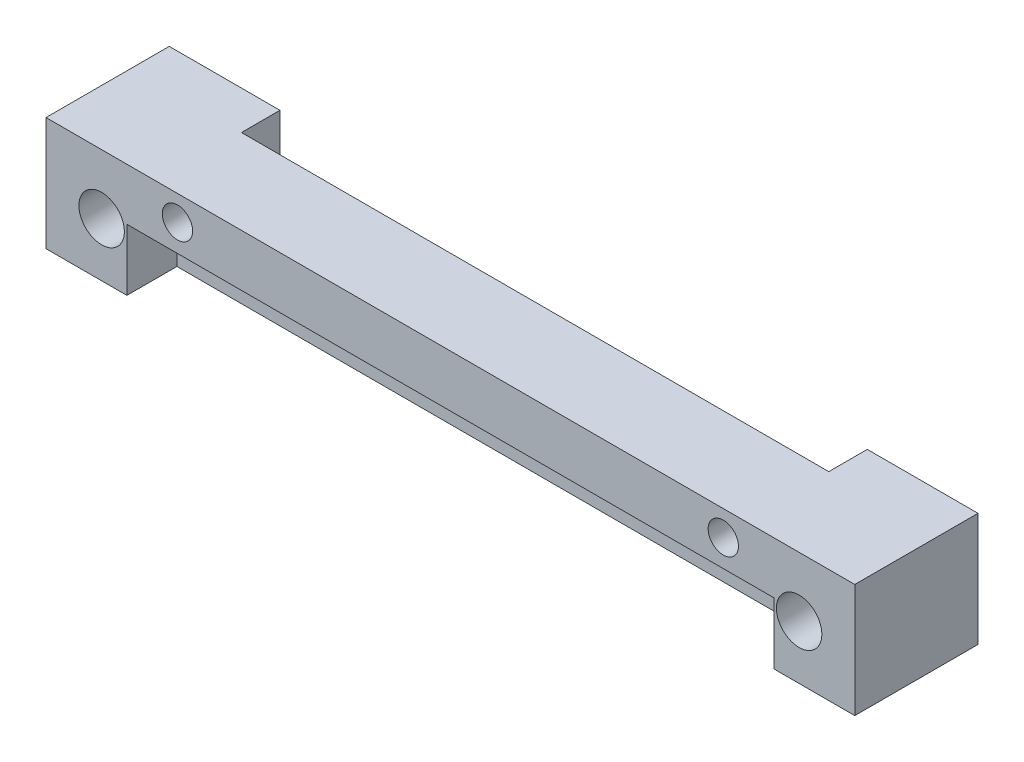
ISO-10303-21;
HEADER;
FILE_DESCRIPTION(('STEP AP214'),'2;1');
FILE_NAME('part.step','',(''),(''),'','','');
FILE_SCHEMA(('AUTOMOTIVE_DESIGN { 1 0 10303 214 1 1 1 1 }'));
ENDSEC;
DATA;
#1=APPLICATION_CONTEXT('core data for automotive mechanical design processes');
#2=APPLICATION_PROTOCOL_DEFINITION('international standard','automotive_design',2000,#1);
#3=PRODUCT_CONTEXT('',#1,'mechanical');
#4=PRODUCT('Part','Part','',(#3));
#5=PRODUCT_RELATED_PRODUCT_CATEGORY('part','',(#4));
#6=PRODUCT_DEFINITION_FORMATION('','',#4);
#7=PRODUCT_DEFINITION_CONTEXT('part definition',#1,'design');
#8=PRODUCT_DEFINITION('design','',#6,#7);
#9=PRODUCT_DEFINITION_SHAPE('','',#8);
#10=(LENGTH_UNIT() NAMED_UNIT(*) SI_UNIT(.MILLI.,.METRE.));
#11=(NAMED_UNIT(*) PLANE_ANGLE_UNIT() SI_UNIT($,.RADIAN.));
#12=(NAMED_UNIT(*) SI_UNIT($,.STERADIAN.) SOLID_ANGLE_UNIT());
#13=UNCERTAINTY_MEASURE_WITH_UNIT(LENGTH_MEASURE(1.E-05),#10,'distance_accuracy_value','');
#14=(GEOMETRIC_REPRESENTATION_CONTEXT(3) GLOBAL_UNCERTAINTY_ASSIGNED_CONTEXT((#13)) GLOBAL_UNIT_ASSIGNED_CONTEXT((#10,
#11,#12)) REPRESENTATION_CONTEXT('',''));
#15=CARTESIAN_POINT('',(0.,0.,0.));
#16=DIRECTION('',(0.,0.,1.));
#17=DIRECTION('',(1.,0.,0.));
#18=AXIS2_PLACEMENT_3D('',#15,#16,#17);
#19=CARTESIAN_POINT('',(-26.67,15.9766,-4.445));
#20=DIRECTION('',(0.,0.,1.));
#21=DIRECTION('',(1.,0.,0.));
#22=AXIS2_PLACEMENT_3D('',#19,#20,#21);
#23=PLANE('',#22);
#24=CARTESIAN_POINT('',(23.,4.064,-4.445));
#25=DIRECTION('',(0.,0.,-1.));
#26=DIRECTION('',(-1.,0.,0.));
#27=AXIS2_PLACEMENT_3D('',#24,#25,#26);
#28=CIRCLE('',#27,1.4986);
#29=CARTESIAN_POINT('',(21.5014,4.064,-4.445));
#30=VERTEX_POINT('',#29);
#31=EDGE_CURVE('E355',#30,#30,#28,.T.);
#32=ORIENTED_EDGE('',*,*,#31,.F.);
#33=EDGE_LOOP('',(#32));
#34=FACE_BOUND('',#33,.T.);
#35=DIRECTION('',(-1.,0.,0.));
#36=VECTOR('',#35,1.);
#37=CARTESIAN_POINT('',(-26.67,0.508,-4.445));
#38=LINE('',#37,#36);
#39=CARTESIAN_POINT('',(26.67,0.508,-4.445));
#40=VERTEX_POINT('',#39);
#41=CARTESIAN_POINT('',(19.3675,0.508,-4.445));
#42=VERTEX_POINT('',#41);
#43=EDGE_CURVE('E349',#40,#42,#38,.T.);
#44=ORIENTED_EDGE('',*,*,#43,.T.);
#45=DIRECTION('',(0.,-1.,0.));
#46=VECTOR('',#45,1.);
#47=CARTESIAN_POINT('',(19.3675,8.001,-4.445));
#48=LINE('',#47,#46);
#49=CARTESIAN_POINT('',(19.3675,8.001,-4.445));
#50=VERTEX_POINT('',#49);
#51=EDGE_CURVE('E168',#50,#42,#48,.T.);
#52=ORIENTED_EDGE('',*,*,#51,.F.);
#53=DIRECTION('',(-1.,0.,0.));
#54=VECTOR('',#53,1.);
#55=CARTESIAN_POINT('',(-26.67,8.001,-4.445));
#56=LINE('',#55,#54);
#57=CARTESIAN_POINT('',(26.67,8.001,-4.445));
#58=VERTEX_POINT('',#57);
#59=EDGE_CURVE('E282',#58,#50,#56,.T.);
#60=ORIENTED_EDGE('',*,*,#59,.F.);
#61=DIRECTION('',(0.,-1.,0.));
#62=VECTOR('',#61,1.);
#63=CARTESIAN_POINT('',(26.67,15.9766,-4.445));
#64=LINE('',#63,#62);
#65=EDGE_CURVE('E12',#58,#40,#64,.T.);
#66=ORIENTED_EDGE('',*,*,#65,.T.);
#67=EDGE_LOOP('',(#44,#52,#60,#66));
#68=FACE_BOUND('',#67,.T.);
#69=ADVANCED_FACE('F47',(#34,#68),#23,.F.);
#70=CARTESIAN_POINT('',(-18.,6.34362935928754,-4.445));
#71=DIRECTION('',(0.,0.,1.));
#72=DIRECTION('',(1.,0.,0.));
#73=AXIS2_PLACEMENT_3D('',#70,#71,#72);
#74=CYLINDRICAL_SURFACE('',#73,1.00000000000001);
#75=CARTESIAN_POINT('',(-18.,6.34362935928754,3.683));
#76=DIRECTION('',(0.,0.,1.));
#77=DIRECTION('',(1.,0.,0.));
#78=AXIS2_PLACEMENT_3D('',#75,#76,#77);
#79=CIRCLE('',#78,1.00000000000001);
#80=CARTESIAN_POINT('',(-17.,6.34362935928754,3.683));
#81=VERTEX_POINT('',#80);
#82=EDGE_CURVE('E213',#81,#81,#79,.T.);
#83=ORIENTED_EDGE('',*,*,#82,.T.);
#84=EDGE_LOOP('',(#83));
#85=FACE_BOUND('',#84,.T.);
#86=CARTESIAN_POINT('',(-18.,6.34362935928754,-1.905));
#87=DIRECTION('',(0.,0.,-1.));
#88=DIRECTION('',(-1.,0.,0.));
#89=AXIS2_PLACEMENT_3D('',#86,#87,#88);
#90=CIRCLE('',#89,1.00000000000001);
#91=CARTESIAN_POINT('',(-19.,6.34362935928754,-1.905));
#92=VERTEX_POINT('',#91);
#93=EDGE_CURVE('E209',#92,#92,#90,.F.);
#94=ORIENTED_EDGE('',*,*,#93,.F.);
#95=EDGE_LOOP('',(#94));
#96=FACE_BOUND('',#95,.T.);
#97=ADVANCED_FACE('F418',(#85,#96),#74,.F.);
#98=CARTESIAN_POINT('',(18.,6.34362935928753,-4.445));
#99=DIRECTION('',(0.,0.,1.));
#100=DIRECTION('',(1.,0.,0.));
#101=AXIS2_PLACEMENT_3D('',#98,#99,#100);
#102=CYLINDRICAL_SURFACE('',#101,1.00000000000001);
#103=CARTESIAN_POINT('',(18.,6.34362935928753,3.683));
#104=DIRECTION('',(0.,0.,1.));
#105=DIRECTION('',(1.,0.,0.));
#106=AXIS2_PLACEMENT_3D('',#103,#104,#105);
#107=CIRCLE('',#106,1.00000000000001);
#108=CARTESIAN_POINT('',(19.,6.34362935928753,3.683));
#109=VERTEX_POINT('',#108);
#110=EDGE_CURVE('E214',#109,#109,#107,.T.);
#111=ORIENTED_EDGE('',*,*,#110,.T.);
#112=EDGE_LOOP('',(#111));
#113=FACE_BOUND('',#112,.T.);
#114=CARTESIAN_POINT('',(18.,6.34362935928753,-1.905));
#115=DIRECTION('',(0.,0.,-1.));
#116=DIRECTION('',(-1.,0.,0.));
#117=AXIS2_PLACEMENT_3D('',#114,#115,#116);
#118=CIRCLE('',#117,1.00000000000001);
#119=CARTESIAN_POINT('',(17.,6.34362935928753,-1.905));
#120=VERTEX_POINT('',#119);
#121=EDGE_CURVE('E52',#120,#120,#118,.F.);
#122=ORIENTED_EDGE('',*,*,#121,.F.);
#123=EDGE_LOOP('',(#122));
#124=FACE_BOUND('',#123,.T.);
#125=ADVANCED_FACE('F415',(#113,#124),#102,.F.);
#126=CARTESIAN_POINT('',(26.67,15.9766,-4.445));
#127=DIRECTION('',(-1.,0.,0.));
#128=DIRECTION('',(0.,0.,1.));
#129=AXIS2_PLACEMENT_3D('',#126,#127,#128);
#130=PLANE('',#129);
#131=ORIENTED_EDGE('',*,*,#65,.F.);
#132=DIRECTION('',(0.,0.,-1.));
#133=VECTOR('',#132,1.);
#134=CARTESIAN_POINT('',(26.67,8.001,3.683));
#135=LINE('',#134,#133);
#136=CARTESIAN_POINT('',(26.67,8.001,3.683));
#137=VERTEX_POINT('',#136);
#138=EDGE_CURVE('E274',#137,#58,#135,.T.);
#139=ORIENTED_EDGE('',*,*,#138,.F.);
#140=DIRECTION('',(0.,1.,0.));
#141=VECTOR('',#140,1.);
#142=CARTESIAN_POINT('',(26.67,15.9766,3.683));
#143=LINE('',#142,#141);
#144=CARTESIAN_POINT('',(26.67,0.508,3.683));
#145=VERTEX_POINT('',#144);
#146=EDGE_CURVE('E333',#145,#137,#143,.T.);
#147=ORIENTED_EDGE('',*,*,#146,.F.);
#148=DIRECTION('',(0.,0.,-1.));
#149=VECTOR('',#148,1.);
#150=CARTESIAN_POINT('',(26.67,0.508,-4.445));
#151=LINE('',#150,#149);
#152=EDGE_CURVE('E339',#145,#40,#151,.T.);
#153=ORIENTED_EDGE('',*,*,#152,.T.);
#154=EDGE_LOOP('',(#131,#139,#147,#153));
#155=FACE_BOUND('',#154,.T.);
#156=ADVANCED_FACE('F50',(#155),#130,.F.);
#157=CARTESIAN_POINT('',(-26.67,15.9766,-4.445));
#158=DIRECTION('',(1.,0.,0.));
#159=DIRECTION('',(0.,0.,-1.));
#160=AXIS2_PLACEMENT_3D('',#157,#158,#159);
#161=PLANE('',#160);
#162=DIRECTION('',(0.,-1.,0.));
#163=VECTOR('',#162,1.);
#164=CARTESIAN_POINT('',(-26.67,15.9766,3.683));
#165=LINE('',#164,#163);
#166=CARTESIAN_POINT('',(-26.67,8.001,3.683));
#167=VERTEX_POINT('',#166);
#168=CARTESIAN_POINT('',(-26.67,0.508,3.683));
#169=VERTEX_POINT('',#168);
#170=EDGE_CURVE('E287',#167,#169,#165,.T.);
#171=ORIENTED_EDGE('',*,*,#170,.F.);
#172=DIRECTION('',(0.,0.,1.));
#173=VECTOR('',#172,1.);
#174=CARTESIAN_POINT('',(-26.67,8.001,3.683));
#175=LINE('',#174,#173);
#176=CARTESIAN_POINT('',(-26.67,8.001,-4.445));
#177=VERTEX_POINT('',#176);
#178=EDGE_CURVE('E313',#177,#167,#175,.T.);
#179=ORIENTED_EDGE('',*,*,#178,.F.);
#180=DIRECTION('',(0.,-1.,0.));
#181=VECTOR('',#180,1.);
#182=CARTESIAN_POINT('',(-26.67,15.9766,-4.445));
#183=LINE('',#182,#181);
#184=CARTESIAN_POINT('',(-26.67,0.508,-4.445));
#185=VERTEX_POINT('',#184);
#186=EDGE_CURVE('E58',#177,#185,#183,.T.);
#187=ORIENTED_EDGE('',*,*,#186,.T.);
#188=DIRECTION('',(0.,0.,1.));
#189=VECTOR('',#188,1.);
#190=CARTESIAN_POINT('',(-26.67,0.508,-4.445));
#191=LINE('',#190,#189);
#192=EDGE_CURVE('E301',#185,#169,#191,.T.);
#193=ORIENTED_EDGE('',*,*,#192,.T.);
#194=EDGE_LOOP('',(#171,#179,#187,#193));
#195=FACE_BOUND('',#194,.T.);
#196=ADVANCED_FACE('F407',(#195),#161,.F.);
#197=CARTESIAN_POINT('',(0.,0.508,0.));
#198=DIRECTION('',(0.,1.,0.));
#199=DIRECTION('',(0.,0.,1.));
#200=AXIS2_PLACEMENT_3D('',#197,#198,#199);
#201=PLANE('',#200);
#202=DIRECTION('',(-1.,0.,0.));
#203=VECTOR('',#202,1.);
#204=CARTESIAN_POINT('',(19.3675,0.508,-1.905));
#205=LINE('',#204,#203);
#206=CARTESIAN_POINT('',(19.3675,0.508,-1.905));
#207=VERTEX_POINT('',#206);
#208=CARTESIAN_POINT('',(-19.3675,0.508,-1.905));
#209=VERTEX_POINT('',#208);
#210=EDGE_CURVE('E179',#207,#209,#205,.T.);
#211=ORIENTED_EDGE('',*,*,#210,.F.);
#212=DIRECTION('',(0.,0.,-1.));
#213=VECTOR('',#212,1.);
#214=CARTESIAN_POINT('',(19.3675,0.508,-1.905));
#215=LINE('',#214,#213);
#216=EDGE_CURVE('E163',#207,#42,#215,.T.);
#217=ORIENTED_EDGE('',*,*,#216,.T.);
#218=ORIENTED_EDGE('',*,*,#43,.F.);
#219=ORIENTED_EDGE('',*,*,#152,.F.);
#220=DIRECTION('',(1.,0.,0.));
#221=VECTOR('',#220,1.);
#222=CARTESIAN_POINT('',(-26.67,0.508,3.683));
#223=LINE('',#222,#221);
#224=CARTESIAN_POINT('',(21.336,0.508,3.683));
#225=VERTEX_POINT('',#224);
#226=EDGE_CURVE('E337',#225,#145,#223,.T.);
#227=ORIENTED_EDGE('',*,*,#226,.F.);
#228=DIRECTION('',(0.,0.,-1.));
#229=VECTOR('',#228,1.);
#230=CARTESIAN_POINT('',(21.336,0.508,0.381));
#231=LINE('',#230,#229);
#232=CARTESIAN_POINT('',(21.336,0.508,0.381));
#233=VERTEX_POINT('',#232);
#234=EDGE_CURVE('E238',#225,#233,#231,.T.);
#235=ORIENTED_EDGE('',*,*,#234,.T.);
#236=DIRECTION('',(-1.,0.,0.));
#237=VECTOR('',#236,1.);
#238=CARTESIAN_POINT('',(21.336,0.508,0.381));
#239=LINE('',#238,#237);
#240=CARTESIAN_POINT('',(-21.336,0.508,0.381));
#241=VERTEX_POINT('',#240);
#242=EDGE_CURVE('E246',#233,#241,#239,.T.);
#243=ORIENTED_EDGE('',*,*,#242,.T.);
#244=DIRECTION('',(0.,0.,-1.));
#245=VECTOR('',#244,1.);
#246=CARTESIAN_POINT('',(-21.336,0.508,0.381));
#247=LINE('',#246,#245);
#248=CARTESIAN_POINT('',(-21.336,0.508,3.683));
#249=VERTEX_POINT('',#248);
#250=EDGE_CURVE('E257',#249,#241,#247,.T.);
#251=ORIENTED_EDGE('',*,*,#250,.F.);
#252=EDGE_CURVE('E340',#169,#249,#223,.T.);
#253=ORIENTED_EDGE('',*,*,#252,.F.);
#254=ORIENTED_EDGE('',*,*,#192,.F.);
#255=CARTESIAN_POINT('',(-19.3675,0.508,-4.445));
#256=VERTEX_POINT('',#255);
#257=EDGE_CURVE('E342',#256,#185,#38,.T.);
#258=ORIENTED_EDGE('',*,*,#257,.F.);
#259=DIRECTION('',(0.,0.,-1.));
#260=VECTOR('',#259,1.);
#261=CARTESIAN_POINT('',(-19.3675,0.508,-1.905));
#262=LINE('',#261,#260);
#263=EDGE_CURVE('E174',#209,#256,#262,.T.);
#264=ORIENTED_EDGE('',*,*,#263,.F.);
#265=EDGE_LOOP('',(#211,#217,#218,#219,#227,#235,#243,#251,#253,#254,#258,#264));
#266=FACE_BOUND('',#265,.T.);
#267=ADVANCED_FACE('F186',(#266),#201,.F.);
#268=CARTESIAN_POINT('',(-23.,4.064,-4.445));
#269=DIRECTION('',(0.,0.,-1.));
#270=DIRECTION('',(-1.,0.,0.));
#271=AXIS2_PLACEMENT_3D('',#268,#269,#270);
#272=CIRCLE('',#271,1.4986);
#273=CARTESIAN_POINT('',(-24.4986,4.064,-4.445));
#274=VERTEX_POINT('',#273);
#275=EDGE_CURVE('E366',#274,#274,#272,.T.);
#276=ORIENTED_EDGE('',*,*,#275,.F.);
#277=EDGE_LOOP('',(#276));
#278=FACE_BOUND('',#277,.T.);
#279=CARTESIAN_POINT('',(-19.3675,8.001,-4.445));
#280=VERTEX_POINT('',#279);
#281=EDGE_CURVE('E278',#280,#177,#56,.T.);
#282=ORIENTED_EDGE('',*,*,#281,.F.);
#283=DIRECTION('',(0.,1.,0.));
#284=VECTOR('',#283,1.);
#285=CARTESIAN_POINT('',(-19.3675,8.001,-4.445));
#286=LINE('',#285,#284);
#287=EDGE_CURVE('E184',#256,#280,#286,.T.);
#288=ORIENTED_EDGE('',*,*,#287,.F.);
#289=ORIENTED_EDGE('',*,*,#257,.T.);
#290=ORIENTED_EDGE('',*,*,#186,.F.);
#291=EDGE_LOOP('',(#282,#288,#289,#290));
#292=FACE_BOUND('',#291,.T.);
#293=ADVANCED_FACE('F393',(#278,#292),#23,.F.);
#294=CARTESIAN_POINT('',(0.,0.,3.683));
#295=DIRECTION('',(0.,0.,1.));
#296=DIRECTION('',(1.,0.,0.));
#297=AXIS2_PLACEMENT_3D('',#294,#295,#296);
#298=PLANE('',#297);
#299=ORIENTED_EDGE('',*,*,#110,.F.);
#300=EDGE_LOOP('',(#299));
#301=FACE_BOUND('',#300,.T.);
#302=ORIENTED_EDGE('',*,*,#82,.F.);
#303=EDGE_LOOP('',(#302));
#304=FACE_BOUND('',#303,.T.);
#305=CARTESIAN_POINT('',(-23.,4.064,3.683));
#306=DIRECTION('',(0.,0.,1.));
#307=DIRECTION('',(1.,0.,0.));
#308=AXIS2_PLACEMENT_3D('',#305,#306,#307);
#309=CIRCLE('',#308,1.4986);
#310=CARTESIAN_POINT('',(-21.5014,4.064,3.683));
#311=VERTEX_POINT('',#310);
#312=EDGE_CURVE('E361',#311,#311,#309,.F.);
#313=ORIENTED_EDGE('',*,*,#312,.T.);
#314=EDGE_LOOP('',(#313));
#315=FACE_BOUND('',#314,.T.);
#316=CARTESIAN_POINT('',(23.,4.064,3.683));
#317=DIRECTION('',(0.,0.,1.));
#318=DIRECTION('',(1.,0.,0.));
#319=AXIS2_PLACEMENT_3D('',#316,#317,#318);
#320=CIRCLE('',#319,1.4986);
#321=CARTESIAN_POINT('',(24.4986,4.064,3.683));
#322=VERTEX_POINT('',#321);
#323=EDGE_CURVE('E219',#322,#322,#320,.F.);
#324=ORIENTED_EDGE('',*,*,#323,.T.);
#325=EDGE_LOOP('',(#324));
#326=FACE_BOUND('',#325,.T.);
#327=DIRECTION('',(0.,-1.,0.));
#328=VECTOR('',#327,1.);
#329=CARTESIAN_POINT('',(21.336,0.508,3.683));
#330=LINE('',#329,#328);
#331=CARTESIAN_POINT('',(21.336,4.572,3.683));
#332=VERTEX_POINT('',#331);
#333=EDGE_CURVE('E232',#332,#225,#330,.T.);
#334=ORIENTED_EDGE('',*,*,#333,.T.);
#335=ORIENTED_EDGE('',*,*,#226,.T.);
#336=ORIENTED_EDGE('',*,*,#146,.T.);
#337=DIRECTION('',(1.,0.,0.));
#338=VECTOR('',#337,1.);
#339=CARTESIAN_POINT('',(-26.67,8.001,3.683));
#340=LINE('',#339,#338);
#341=EDGE_CURVE('E279',#167,#137,#340,.T.);
#342=ORIENTED_EDGE('',*,*,#341,.F.);
#343=ORIENTED_EDGE('',*,*,#170,.T.);
#344=ORIENTED_EDGE('',*,*,#252,.T.);
#345=DIRECTION('',(0.,-1.,0.));
#346=VECTOR('',#345,1.);
#347=CARTESIAN_POINT('',(-21.336,0.508,3.683));
#348=LINE('',#347,#346);
#349=CARTESIAN_POINT('',(-21.336,4.572,3.683));
#350=VERTEX_POINT('',#349);
#351=EDGE_CURVE('E263',#350,#249,#348,.T.);
#352=ORIENTED_EDGE('',*,*,#351,.F.);
#353=DIRECTION('',(-1.,0.,0.));
#354=VECTOR('',#353,1.);
#355=CARTESIAN_POINT('',(21.336,4.572,3.683));
#356=LINE('',#355,#354);
#357=EDGE_CURVE('E314',#332,#350,#356,.T.);
#358=ORIENTED_EDGE('',*,*,#357,.F.);
#359=EDGE_LOOP('',(#334,#335,#336,#342,#343,#344,#352,#358));
#360=FACE_BOUND('',#359,.T.);
#361=ADVANCED_FACE('F335',(#301,#304,#315,#326,#360),#298,.T.);
#362=CARTESIAN_POINT('',(0.,8.001,0.));
#363=DIRECTION('',(0.,-1.,0.));
#364=DIRECTION('',(0.,0.,-1.));
#365=AXIS2_PLACEMENT_3D('',#362,#363,#364);
#366=PLANE('',#365);
#367=ORIENTED_EDGE('',*,*,#59,.T.);
#368=DIRECTION('',(0.,0.,-1.));
#369=VECTOR('',#368,1.);
#370=CARTESIAN_POINT('',(19.3675,8.001,-1.905));
#371=LINE('',#370,#369);
#372=CARTESIAN_POINT('',(19.3675,8.001,-1.905));
#373=VERTEX_POINT('',#372);
#374=EDGE_CURVE('E376',#373,#50,#371,.T.);
#375=ORIENTED_EDGE('',*,*,#374,.F.);
#376=DIRECTION('',(1.,0.,0.));
#377=VECTOR('',#376,1.);
#378=CARTESIAN_POINT('',(19.3675,8.001,-1.905));
#379=LINE('',#378,#377);
#380=CARTESIAN_POINT('',(-19.3675,8.001,-1.905));
#381=VERTEX_POINT('',#380);
#382=EDGE_CURVE('E175',#381,#373,#379,.T.);
#383=ORIENTED_EDGE('',*,*,#382,.F.);
#384=DIRECTION('',(0.,0.,-1.));
#385=VECTOR('',#384,1.);
#386=CARTESIAN_POINT('',(-19.3675,8.001,-1.905));
#387=LINE('',#386,#385);
#388=EDGE_CURVE('E381',#381,#280,#387,.T.);
#389=ORIENTED_EDGE('',*,*,#388,.T.);
#390=ORIENTED_EDGE('',*,*,#281,.T.);
#391=ORIENTED_EDGE('',*,*,#178,.T.);
#392=ORIENTED_EDGE('',*,*,#341,.T.);
#393=ORIENTED_EDGE('',*,*,#138,.T.);
#394=EDGE_LOOP('',(#367,#375,#383,#389,#390,#391,#392,#393));
#395=FACE_BOUND('',#394,.T.);
#396=ADVANCED_FACE('F324',(#395),#366,.F.);
#397=CARTESIAN_POINT('',(21.336,0.508,0.381));
#398=DIRECTION('',(0.,0.,1.));
#399=DIRECTION('',(1.,0.,0.));
#400=AXIS2_PLACEMENT_3D('',#397,#398,#399);
#401=PLANE('',#400);
#402=ORIENTED_EDGE('',*,*,#242,.F.);
#403=DIRECTION('',(0.,1.,0.));
#404=VECTOR('',#403,1.);
#405=CARTESIAN_POINT('',(21.336,0.508,0.381));
#406=LINE('',#405,#404);
#407=CARTESIAN_POINT('',(21.336,4.572,0.381));
#408=VERTEX_POINT('',#407);
#409=EDGE_CURVE('E262',#233,#408,#406,.T.);
#410=ORIENTED_EDGE('',*,*,#409,.T.);
#411=DIRECTION('',(-1.,0.,0.));
#412=VECTOR('',#411,1.);
#413=CARTESIAN_POINT('',(21.336,4.572,0.381));
#414=LINE('',#413,#412);
#415=CARTESIAN_POINT('',(-21.336,4.572,0.381));
#416=VERTEX_POINT('',#415);
#417=EDGE_CURVE('E310',#408,#416,#414,.T.);
#418=ORIENTED_EDGE('',*,*,#417,.T.);
#419=DIRECTION('',(0.,1.,0.));
#420=VECTOR('',#419,1.);
#421=CARTESIAN_POINT('',(-21.336,0.508,0.381));
#422=LINE('',#421,#420);
#423=EDGE_CURVE('E363',#241,#416,#422,.T.);
#424=ORIENTED_EDGE('',*,*,#423,.F.);
#425=EDGE_LOOP('',(#402,#410,#418,#424));
#426=FACE_BOUND('',#425,.T.);
#427=ADVANCED_FACE('F480',(#426),#401,.T.);
#428=CARTESIAN_POINT('',(21.336,4.572,0.381));
#429=DIRECTION('',(0.,-1.,0.));
#430=DIRECTION('',(0.,0.,-1.));
#431=AXIS2_PLACEMENT_3D('',#428,#429,#430);
#432=PLANE('',#431);
#433=ORIENTED_EDGE('',*,*,#417,.F.);
#434=DIRECTION('',(0.,0.,1.));
#435=VECTOR('',#434,1.);
#436=CARTESIAN_POINT('',(21.336,4.572,0.381));
#437=LINE('',#436,#435);
#438=EDGE_CURVE('E239',#408,#332,#437,.T.);
#439=ORIENTED_EDGE('',*,*,#438,.T.);
#440=ORIENTED_EDGE('',*,*,#357,.T.);
#441=DIRECTION('',(0.,0.,1.));
#442=VECTOR('',#441,1.);
#443=CARTESIAN_POINT('',(-21.336,4.572,0.381));
#444=LINE('',#443,#442);
#445=EDGE_CURVE('E79',#416,#350,#444,.T.);
#446=ORIENTED_EDGE('',*,*,#445,.F.);
#447=EDGE_LOOP('',(#433,#439,#440,#446));
#448=FACE_BOUND('',#447,.T.);
#449=ADVANCED_FACE('F474',(#448),#432,.T.);
#450=CARTESIAN_POINT('',(21.336,0.,0.));
#451=DIRECTION('',(1.,0.,0.));
#452=DIRECTION('',(0.,0.,-1.));
#453=AXIS2_PLACEMENT_3D('',#450,#451,#452);
#454=PLANE('',#453);
#455=ORIENTED_EDGE('',*,*,#409,.F.);
#456=ORIENTED_EDGE('',*,*,#234,.F.);
#457=ORIENTED_EDGE('',*,*,#333,.F.);
#458=ORIENTED_EDGE('',*,*,#438,.F.);
#459=EDGE_LOOP('',(#455,#456,#457,#458));
#460=FACE_BOUND('',#459,.T.);
#461=ADVANCED_FACE('F470',(#460),#454,.F.);
#462=CARTESIAN_POINT('',(-21.336,0.,0.));
#463=DIRECTION('',(1.,0.,0.));
#464=DIRECTION('',(0.,0.,-1.));
#465=AXIS2_PLACEMENT_3D('',#462,#463,#464);
#466=PLANE('',#465);
#467=ORIENTED_EDGE('',*,*,#423,.T.);
#468=ORIENTED_EDGE('',*,*,#445,.T.);
#469=ORIENTED_EDGE('',*,*,#351,.T.);
#470=ORIENTED_EDGE('',*,*,#250,.T.);
#471=EDGE_LOOP('',(#467,#468,#469,#470));
#472=FACE_BOUND('',#471,.T.);
#473=ADVANCED_FACE('F456',(#472),#466,.T.);
#474=CARTESIAN_POINT('',(23.,4.064,3.684));
#475=DIRECTION('',(0.,0.,-1.));
#476=DIRECTION('',(-1.,0.,0.));
#477=AXIS2_PLACEMENT_3D('',#474,#475,#476);
#478=CYLINDRICAL_SURFACE('',#477,1.4986);
#479=ORIENTED_EDGE('',*,*,#323,.F.);
#480=EDGE_LOOP('',(#479));
#481=FACE_BOUND('',#480,.T.);
#482=ORIENTED_EDGE('',*,*,#31,.T.);
#483=EDGE_LOOP('',(#482));
#484=FACE_BOUND('',#483,.T.);
#485=ADVANCED_FACE('F449',(#481,#484),#478,.F.);
#486=CARTESIAN_POINT('',(-23.,4.064,3.684));
#487=DIRECTION('',(0.,0.,-1.));
#488=DIRECTION('',(-1.,0.,0.));
#489=AXIS2_PLACEMENT_3D('',#486,#487,#488);
#490=CYLINDRICAL_SURFACE('',#489,1.4986);
#491=ORIENTED_EDGE('',*,*,#312,.F.);
#492=EDGE_LOOP('',(#491));
#493=FACE_BOUND('',#492,.T.);
#494=ORIENTED_EDGE('',*,*,#275,.T.);
#495=EDGE_LOOP('',(#494));
#496=FACE_BOUND('',#495,.T.);
#497=ADVANCED_FACE('F447',(#493,#496),#490,.F.);
#498=CARTESIAN_POINT('',(0.,0.,-1.905));
#499=DIRECTION('',(0.,0.,-1.));
#500=DIRECTION('',(-1.,0.,0.));
#501=AXIS2_PLACEMENT_3D('',#498,#499,#500);
#502=PLANE('',#501);
#503=DIRECTION('',(0.,-1.,0.));
#504=VECTOR('',#503,1.);
#505=CARTESIAN_POINT('',(19.3675,8.001,-1.905));
#506=LINE('',#505,#504);
#507=EDGE_CURVE('E166',#373,#207,#506,.T.);
#508=ORIENTED_EDGE('',*,*,#507,.T.);
#509=ORIENTED_EDGE('',*,*,#210,.T.);
#510=DIRECTION('',(0.,1.,0.));
#511=VECTOR('',#510,1.);
#512=CARTESIAN_POINT('',(-19.3675,8.001,-1.905));
#513=LINE('',#512,#511);
#514=EDGE_CURVE('E68',#209,#381,#513,.T.);
#515=ORIENTED_EDGE('',*,*,#514,.T.);
#516=ORIENTED_EDGE('',*,*,#382,.T.);
#517=EDGE_LOOP('',(#508,#509,#515,#516));
#518=FACE_BOUND('',#517,.T.);
#519=ORIENTED_EDGE('',*,*,#121,.T.);
#520=EDGE_LOOP('',(#519));
#521=FACE_BOUND('',#520,.T.);
#522=ORIENTED_EDGE('',*,*,#93,.T.);
#523=EDGE_LOOP('',(#522));
#524=FACE_BOUND('',#523,.T.);
#525=ADVANCED_FACE('F177',(#518,#521,#524),#502,.T.);
#526=CARTESIAN_POINT('',(19.3675,8.001,-1.905));
#527=DIRECTION('',(1.,0.,0.));
#528=DIRECTION('',(0.,0.,-1.));
#529=AXIS2_PLACEMENT_3D('',#526,#527,#528);
#530=PLANE('',#529);
#531=ORIENTED_EDGE('',*,*,#51,.T.);
#532=ORIENTED_EDGE('',*,*,#216,.F.);
#533=ORIENTED_EDGE('',*,*,#507,.F.);
#534=ORIENTED_EDGE('',*,*,#374,.T.);
#535=EDGE_LOOP('',(#531,#532,#533,#534));
#536=FACE_BOUND('',#535,.T.);
#537=ADVANCED_FACE('F165',(#536),#530,.F.);
#538=CARTESIAN_POINT('',(-19.3675,8.001,-1.905));
#539=DIRECTION('',(-1.,0.,0.));
#540=DIRECTION('',(0.,0.,1.));
#541=AXIS2_PLACEMENT_3D('',#538,#539,#540);
#542=PLANE('',#541);
#543=ORIENTED_EDGE('',*,*,#287,.T.);
#544=ORIENTED_EDGE('',*,*,#388,.F.);
#545=ORIENTED_EDGE('',*,*,#514,.F.);
#546=ORIENTED_EDGE('',*,*,#263,.T.);
#547=EDGE_LOOP('',(#543,#544,#545,#546));
#548=FACE_BOUND('',#547,.T.);
#549=ADVANCED_FACE('F391',(#548),#542,.F.);
#550=CLOSED_SHELL('',(#69,#97,#125,#156,#196,#267,#293,#361,#396,#427,#449,#461,#473,#485,#497,
#525,#537,#549));
#551=MANIFOLD_SOLID_BREP('B2',#550);
#552=ADVANCED_BREP_SHAPE_REPRESENTATION('',(#18,#551),#14);
#553=SHAPE_DEFINITION_REPRESENTATION(#9,#552);
ENDSEC;
END-ISO-10303-21;
